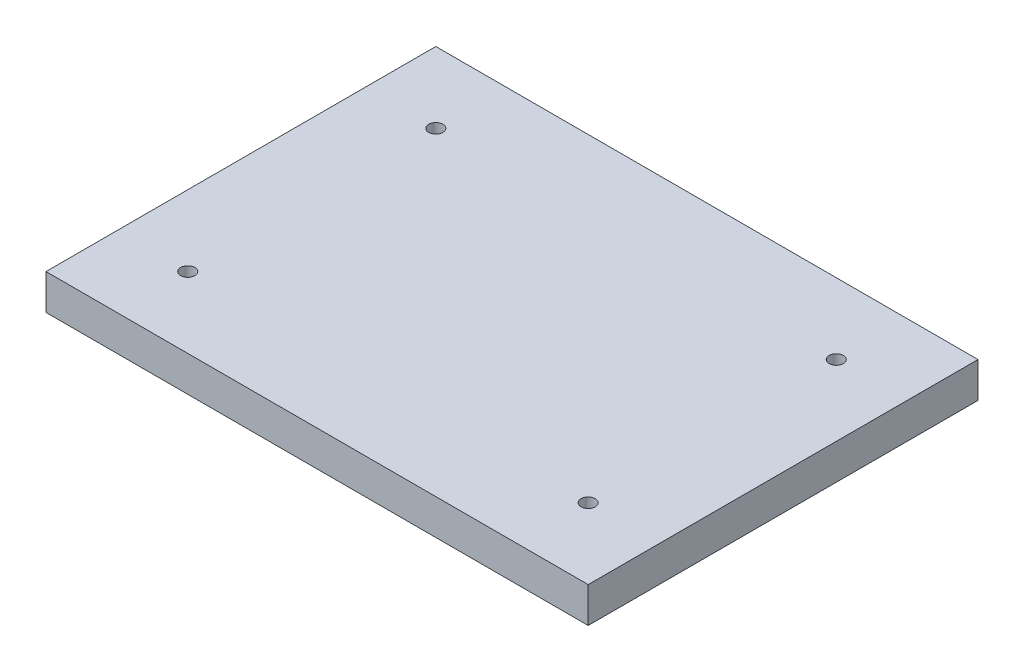
ISO-10303-21;
HEADER;
FILE_DESCRIPTION(('STEP AP214'),'2;1');
FILE_NAME('part.step','',(''),(''),'','','');
FILE_SCHEMA(('AUTOMOTIVE_DESIGN { 1 0 10303 214 1 1 1 1 }'));
ENDSEC;
DATA;
#1=APPLICATION_CONTEXT('core data for automotive mechanical design processes');
#2=APPLICATION_PROTOCOL_DEFINITION('international standard','automotive_design',2000,#1);
#3=PRODUCT_CONTEXT('',#1,'mechanical');
#4=PRODUCT('Part','Part','',(#3));
#5=PRODUCT_RELATED_PRODUCT_CATEGORY('part','',(#4));
#6=PRODUCT_DEFINITION_FORMATION('','',#4);
#7=PRODUCT_DEFINITION_CONTEXT('part definition',#1,'design');
#8=PRODUCT_DEFINITION('design','',#6,#7);
#9=PRODUCT_DEFINITION_SHAPE('','',#8);
#10=(LENGTH_UNIT() NAMED_UNIT(*) SI_UNIT(.MILLI.,.METRE.));
#11=(NAMED_UNIT(*) PLANE_ANGLE_UNIT() SI_UNIT($,.RADIAN.));
#12=(NAMED_UNIT(*) SI_UNIT($,.STERADIAN.) SOLID_ANGLE_UNIT());
#13=UNCERTAINTY_MEASURE_WITH_UNIT(LENGTH_MEASURE(1.E-05),#10,'distance_accuracy_value','');
#14=(GEOMETRIC_REPRESENTATION_CONTEXT(3) GLOBAL_UNCERTAINTY_ASSIGNED_CONTEXT((#13)) GLOBAL_UNIT_ASSIGNED_CONTEXT((#10,
#11,#12)) REPRESENTATION_CONTEXT('',''));
#15=CARTESIAN_POINT('',(0.,0.,0.));
#16=DIRECTION('',(0.,0.,1.));
#17=DIRECTION('',(1.,0.,0.));
#18=AXIS2_PLACEMENT_3D('',#15,#16,#17);
#19=CARTESIAN_POINT('',(0.,10.,0.));
#20=DIRECTION('',(0.,1.,0.));
#21=DIRECTION('',(0.,0.,1.));
#22=AXIS2_PLACEMENT_3D('',#19,#20,#21);
#23=PLANE('',#22);
#24=CARTESIAN_POINT('',(122.,10.,-105.));
#25=DIRECTION('',(0.,1.,0.));
#26=DIRECTION('',(0.,0.,1.));
#27=AXIS2_PLACEMENT_3D('',#24,#25,#26);
#28=CIRCLE('',#27,2.);
#29=CARTESIAN_POINT('',(122.,10.,-103.));
#30=VERTEX_POINT('',#29);
#31=EDGE_CURVE('E142',#30,#30,#28,.T.);
#32=ORIENTED_EDGE('',*,*,#31,.F.);
#33=EDGE_LOOP('',(#32));
#34=FACE_BOUND('',#33,.T.);
#35=CARTESIAN_POINT('',(235.,10.,-35.));
#36=DIRECTION('',(0.,1.,0.));
#37=DIRECTION('',(0.,0.,1.));
#38=AXIS2_PLACEMENT_3D('',#35,#36,#37);
#39=CIRCLE('',#38,2.);
#40=CARTESIAN_POINT('',(235.,10.,-33.));
#41=VERTEX_POINT('',#40);
#42=EDGE_CURVE('E112',#41,#41,#39,.T.);
#43=ORIENTED_EDGE('',*,*,#42,.F.);
#44=EDGE_LOOP('',(#43));
#45=FACE_BOUND('',#44,.T.);
#46=DIRECTION('',(-1.,0.,0.));
#47=VECTOR('',#46,1.);
#48=CARTESIAN_POINT('',(102.,10.,-125.));
#49=LINE('',#48,#47);
#50=CARTESIAN_POINT('',(255.,10.,-125.));
#51=VERTEX_POINT('',#50);
#52=CARTESIAN_POINT('',(102.,10.,-125.));
#53=VERTEX_POINT('',#52);
#54=EDGE_CURVE('E92',#51,#53,#49,.T.);
#55=ORIENTED_EDGE('',*,*,#54,.T.);
#56=DIRECTION('',(0.,0.,1.));
#57=VECTOR('',#56,1.);
#58=CARTESIAN_POINT('',(102.,10.,-125.));
#59=LINE('',#58,#57);
#60=CARTESIAN_POINT('',(102.,10.,-15.));
#61=VERTEX_POINT('',#60);
#62=EDGE_CURVE('E87',#53,#61,#59,.T.);
#63=ORIENTED_EDGE('',*,*,#62,.T.);
#64=DIRECTION('',(1.,0.,0.));
#65=VECTOR('',#64,1.);
#66=CARTESIAN_POINT('',(102.,10.,-15.));
#67=LINE('',#66,#65);
#68=CARTESIAN_POINT('',(255.,10.,-15.));
#69=VERTEX_POINT('',#68);
#70=EDGE_CURVE('E90',#61,#69,#67,.T.);
#71=ORIENTED_EDGE('',*,*,#70,.T.);
#72=DIRECTION('',(0.,0.,-1.));
#73=VECTOR('',#72,1.);
#74=CARTESIAN_POINT('',(255.,10.,-15.));
#75=LINE('',#74,#73);
#76=EDGE_CURVE('E57',#69,#51,#75,.T.);
#77=ORIENTED_EDGE('',*,*,#76,.T.);
#78=EDGE_LOOP('',(#55,#63,#71,#77));
#79=FACE_BOUND('',#78,.T.);
#80=CARTESIAN_POINT('',(235.,10.,-105.));
#81=DIRECTION('',(0.,1.,0.));
#82=DIRECTION('',(0.,0.,1.));
#83=AXIS2_PLACEMENT_3D('',#80,#81,#82);
#84=CIRCLE('',#83,2.);
#85=CARTESIAN_POINT('',(235.,10.,-103.));
#86=VERTEX_POINT('',#85);
#87=EDGE_CURVE('E134',#86,#86,#84,.T.);
#88=ORIENTED_EDGE('',*,*,#87,.F.);
#89=EDGE_LOOP('',(#88));
#90=FACE_BOUND('',#89,.T.);
#91=CARTESIAN_POINT('',(122.,10.,-35.));
#92=DIRECTION('',(0.,1.,0.));
#93=DIRECTION('',(0.,0.,1.));
#94=AXIS2_PLACEMENT_3D('',#91,#92,#93);
#95=CIRCLE('',#94,2.);
#96=CARTESIAN_POINT('',(122.,10.,-33.));
#97=VERTEX_POINT('',#96);
#98=EDGE_CURVE('E150',#97,#97,#95,.T.);
#99=ORIENTED_EDGE('',*,*,#98,.F.);
#100=EDGE_LOOP('',(#99));
#101=FACE_BOUND('',#100,.T.);
#102=ADVANCED_FACE('F39',(#34,#45,#79,#90,#101),#23,.T.);
#103=CARTESIAN_POINT('',(0.,0.,0.));
#104=DIRECTION('',(0.,1.,0.));
#105=DIRECTION('',(0.,0.,1.));
#106=AXIS2_PLACEMENT_3D('',#103,#104,#105);
#107=PLANE('',#106);
#108=DIRECTION('',(-1.,0.,0.));
#109=VECTOR('',#108,1.);
#110=CARTESIAN_POINT('',(102.,0.,-125.));
#111=LINE('',#110,#109);
#112=CARTESIAN_POINT('',(255.,0.,-125.));
#113=VERTEX_POINT('',#112);
#114=CARTESIAN_POINT('',(102.,0.,-125.));
#115=VERTEX_POINT('',#114);
#116=EDGE_CURVE('E108',#113,#115,#111,.T.);
#117=ORIENTED_EDGE('',*,*,#116,.F.);
#118=DIRECTION('',(0.,0.,-1.));
#119=VECTOR('',#118,1.);
#120=CARTESIAN_POINT('',(255.,0.,-15.));
#121=LINE('',#120,#119);
#122=CARTESIAN_POINT('',(255.,0.,-15.));
#123=VERTEX_POINT('',#122);
#124=EDGE_CURVE('E80',#123,#113,#121,.T.);
#125=ORIENTED_EDGE('',*,*,#124,.F.);
#126=DIRECTION('',(1.,0.,0.));
#127=VECTOR('',#126,1.);
#128=CARTESIAN_POINT('',(102.,0.,-15.));
#129=LINE('',#128,#127);
#130=CARTESIAN_POINT('',(102.,0.,-15.));
#131=VERTEX_POINT('',#130);
#132=EDGE_CURVE('E74',#131,#123,#129,.T.);
#133=ORIENTED_EDGE('',*,*,#132,.F.);
#134=DIRECTION('',(0.,0.,1.));
#135=VECTOR('',#134,1.);
#136=CARTESIAN_POINT('',(102.,0.,-125.));
#137=LINE('',#136,#135);
#138=EDGE_CURVE('E97',#115,#131,#137,.T.);
#139=ORIENTED_EDGE('',*,*,#138,.F.);
#140=EDGE_LOOP('',(#117,#125,#133,#139));
#141=FACE_BOUND('',#140,.T.);
#142=CARTESIAN_POINT('',(235.,0.,-35.));
#143=DIRECTION('',(0.,1.,0.));
#144=DIRECTION('',(0.,0.,1.));
#145=AXIS2_PLACEMENT_3D('',#142,#143,#144);
#146=CIRCLE('',#145,2.);
#147=CARTESIAN_POINT('',(235.,0.,-33.));
#148=VERTEX_POINT('',#147);
#149=EDGE_CURVE('E130',#148,#148,#146,.T.);
#150=ORIENTED_EDGE('',*,*,#149,.T.);
#151=EDGE_LOOP('',(#150));
#152=FACE_BOUND('',#151,.T.);
#153=CARTESIAN_POINT('',(235.,0.,-105.));
#154=DIRECTION('',(0.,1.,0.));
#155=DIRECTION('',(0.,0.,1.));
#156=AXIS2_PLACEMENT_3D('',#153,#154,#155);
#157=CIRCLE('',#156,2.);
#158=CARTESIAN_POINT('',(235.,0.,-103.));
#159=VERTEX_POINT('',#158);
#160=EDGE_CURVE('E138',#159,#159,#157,.T.);
#161=ORIENTED_EDGE('',*,*,#160,.T.);
#162=EDGE_LOOP('',(#161));
#163=FACE_BOUND('',#162,.T.);
#164=CARTESIAN_POINT('',(122.,0.,-105.));
#165=DIRECTION('',(0.,1.,0.));
#166=DIRECTION('',(0.,0.,1.));
#167=AXIS2_PLACEMENT_3D('',#164,#165,#166);
#168=CIRCLE('',#167,2.);
#169=CARTESIAN_POINT('',(122.,0.,-103.));
#170=VERTEX_POINT('',#169);
#171=EDGE_CURVE('E146',#170,#170,#168,.T.);
#172=ORIENTED_EDGE('',*,*,#171,.T.);
#173=EDGE_LOOP('',(#172));
#174=FACE_BOUND('',#173,.T.);
#175=CARTESIAN_POINT('',(122.,0.,-35.));
#176=DIRECTION('',(0.,1.,0.));
#177=DIRECTION('',(0.,0.,1.));
#178=AXIS2_PLACEMENT_3D('',#175,#176,#177);
#179=CIRCLE('',#178,2.);
#180=CARTESIAN_POINT('',(122.,0.,-33.));
#181=VERTEX_POINT('',#180);
#182=EDGE_CURVE('E154',#181,#181,#179,.T.);
#183=ORIENTED_EDGE('',*,*,#182,.T.);
#184=EDGE_LOOP('',(#183));
#185=FACE_BOUND('',#184,.T.);
#186=ADVANCED_FACE('F125',(#141,#152,#163,#174,#185),#107,.F.);
#187=CARTESIAN_POINT('',(102.,10.,-125.));
#188=DIRECTION('',(0.,0.,1.));
#189=DIRECTION('',(1.,0.,0.));
#190=AXIS2_PLACEMENT_3D('',#187,#188,#189);
#191=PLANE('',#190);
#192=ORIENTED_EDGE('',*,*,#116,.T.);
#193=DIRECTION('',(0.,-1.,0.));
#194=VECTOR('',#193,1.);
#195=CARTESIAN_POINT('',(102.,10.,-125.));
#196=LINE('',#195,#194);
#197=EDGE_CURVE('E11',#53,#115,#196,.T.);
#198=ORIENTED_EDGE('',*,*,#197,.F.);
#199=ORIENTED_EDGE('',*,*,#54,.F.);
#200=DIRECTION('',(0.,-1.,0.));
#201=VECTOR('',#200,1.);
#202=CARTESIAN_POINT('',(255.,10.,-125.));
#203=LINE('',#202,#201);
#204=EDGE_CURVE('E104',#51,#113,#203,.T.);
#205=ORIENTED_EDGE('',*,*,#204,.T.);
#206=EDGE_LOOP('',(#192,#198,#199,#205));
#207=FACE_BOUND('',#206,.T.);
#208=ADVANCED_FACE('F41',(#207),#191,.F.);
#209=CARTESIAN_POINT('',(102.,10.,-125.));
#210=DIRECTION('',(1.,0.,0.));
#211=DIRECTION('',(0.,0.,-1.));
#212=AXIS2_PLACEMENT_3D('',#209,#210,#211);
#213=PLANE('',#212);
#214=ORIENTED_EDGE('',*,*,#138,.T.);
#215=DIRECTION('',(0.,-1.,0.));
#216=VECTOR('',#215,1.);
#217=CARTESIAN_POINT('',(102.,10.,-15.));
#218=LINE('',#217,#216);
#219=EDGE_CURVE('E49',#61,#131,#218,.T.);
#220=ORIENTED_EDGE('',*,*,#219,.F.);
#221=ORIENTED_EDGE('',*,*,#62,.F.);
#222=ORIENTED_EDGE('',*,*,#197,.T.);
#223=EDGE_LOOP('',(#214,#220,#221,#222));
#224=FACE_BOUND('',#223,.T.);
#225=ADVANCED_FACE('F96',(#224),#213,.F.);
#226=CARTESIAN_POINT('',(102.,10.,-15.));
#227=DIRECTION('',(0.,0.,-1.));
#228=DIRECTION('',(-1.,0.,0.));
#229=AXIS2_PLACEMENT_3D('',#226,#227,#228);
#230=PLANE('',#229);
#231=ORIENTED_EDGE('',*,*,#132,.T.);
#232=DIRECTION('',(0.,-1.,0.));
#233=VECTOR('',#232,1.);
#234=CARTESIAN_POINT('',(255.,10.,-15.));
#235=LINE('',#234,#233);
#236=EDGE_CURVE('E99',#69,#123,#235,.T.);
#237=ORIENTED_EDGE('',*,*,#236,.F.);
#238=ORIENTED_EDGE('',*,*,#70,.F.);
#239=ORIENTED_EDGE('',*,*,#219,.T.);
#240=EDGE_LOOP('',(#231,#237,#238,#239));
#241=FACE_BOUND('',#240,.T.);
#242=ADVANCED_FACE('F100',(#241),#230,.F.);
#243=CARTESIAN_POINT('',(255.,10.,-15.));
#244=DIRECTION('',(-1.,0.,0.));
#245=DIRECTION('',(0.,0.,1.));
#246=AXIS2_PLACEMENT_3D('',#243,#244,#245);
#247=PLANE('',#246);
#248=ORIENTED_EDGE('',*,*,#124,.T.);
#249=ORIENTED_EDGE('',*,*,#204,.F.);
#250=ORIENTED_EDGE('',*,*,#76,.F.);
#251=ORIENTED_EDGE('',*,*,#236,.T.);
#252=EDGE_LOOP('',(#248,#249,#250,#251));
#253=FACE_BOUND('',#252,.T.);
#254=ADVANCED_FACE('F122',(#253),#247,.F.);
#255=CARTESIAN_POINT('',(235.,10.,-35.));
#256=DIRECTION('',(0.,-1.,0.));
#257=DIRECTION('',(0.,0.,-1.));
#258=AXIS2_PLACEMENT_3D('',#255,#256,#257);
#259=CYLINDRICAL_SURFACE('',#258,2.);
#260=ORIENTED_EDGE('',*,*,#42,.T.);
#261=EDGE_LOOP('',(#260));
#262=FACE_BOUND('',#261,.T.);
#263=ORIENTED_EDGE('',*,*,#149,.F.);
#264=EDGE_LOOP('',(#263));
#265=FACE_BOUND('',#264,.T.);
#266=ADVANCED_FACE('F175',(#262,#265),#259,.F.);
#267=CARTESIAN_POINT('',(235.,10.,-105.));
#268=DIRECTION('',(0.,-1.,0.));
#269=DIRECTION('',(0.,0.,-1.));
#270=AXIS2_PLACEMENT_3D('',#267,#268,#269);
#271=CYLINDRICAL_SURFACE('',#270,2.);
#272=ORIENTED_EDGE('',*,*,#87,.T.);
#273=EDGE_LOOP('',(#272));
#274=FACE_BOUND('',#273,.T.);
#275=ORIENTED_EDGE('',*,*,#160,.F.);
#276=EDGE_LOOP('',(#275));
#277=FACE_BOUND('',#276,.T.);
#278=ADVANCED_FACE('F221',(#274,#277),#271,.F.);
#279=CARTESIAN_POINT('',(122.,10.,-105.));
#280=DIRECTION('',(0.,-1.,0.));
#281=DIRECTION('',(0.,0.,-1.));
#282=AXIS2_PLACEMENT_3D('',#279,#280,#281);
#283=CYLINDRICAL_SURFACE('',#282,2.);
#284=ORIENTED_EDGE('',*,*,#31,.T.);
#285=EDGE_LOOP('',(#284));
#286=FACE_BOUND('',#285,.T.);
#287=ORIENTED_EDGE('',*,*,#171,.F.);
#288=EDGE_LOOP('',(#287));
#289=FACE_BOUND('',#288,.T.);
#290=ADVANCED_FACE('F229',(#286,#289),#283,.F.);
#291=CARTESIAN_POINT('',(122.,10.,-35.));
#292=DIRECTION('',(0.,-1.,0.));
#293=DIRECTION('',(0.,0.,-1.));
#294=AXIS2_PLACEMENT_3D('',#291,#292,#293);
#295=CYLINDRICAL_SURFACE('',#294,2.);
#296=ORIENTED_EDGE('',*,*,#98,.T.);
#297=EDGE_LOOP('',(#296));
#298=FACE_BOUND('',#297,.T.);
#299=ORIENTED_EDGE('',*,*,#182,.F.);
#300=EDGE_LOOP('',(#299));
#301=FACE_BOUND('',#300,.T.);
#302=ADVANCED_FACE('F162',(#298,#301),#295,.F.);
#303=CLOSED_SHELL('',(#102,#186,#208,#225,#242,#254,#266,#278,#290,#302));
#304=MANIFOLD_SOLID_BREP('B2',#303);
#305=ADVANCED_BREP_SHAPE_REPRESENTATION('',(#18,#304),#14);
#306=SHAPE_DEFINITION_REPRESENTATION(#9,#305);
ENDSEC;
END-ISO-10303-21;
